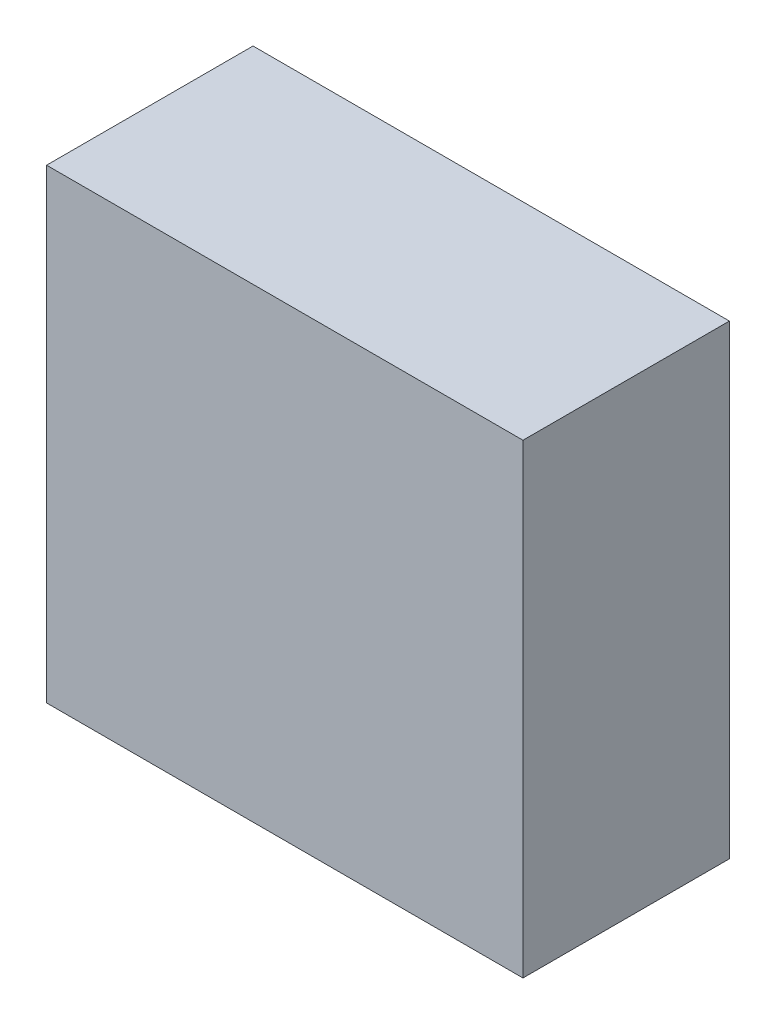
ISO-10303-21;
HEADER;
FILE_DESCRIPTION(('STEP AP214'),'2;1');
FILE_NAME('part.step','',(''),(''),'','','');
FILE_SCHEMA(('AUTOMOTIVE_DESIGN { 1 0 10303 214 1 1 1 1 }'));
ENDSEC;
DATA;
#1=APPLICATION_CONTEXT('core data for automotive mechanical design processes');
#2=APPLICATION_PROTOCOL_DEFINITION('international standard','automotive_design',2000,#1);
#3=PRODUCT_CONTEXT('',#1,'mechanical');
#4=PRODUCT('Part','Part','',(#3));
#5=PRODUCT_RELATED_PRODUCT_CATEGORY('part','',(#4));
#6=PRODUCT_DEFINITION_FORMATION('','',#4);
#7=PRODUCT_DEFINITION_CONTEXT('part definition',#1,'design');
#8=PRODUCT_DEFINITION('design','',#6,#7);
#9=PRODUCT_DEFINITION_SHAPE('','',#8);
#10=(LENGTH_UNIT() NAMED_UNIT(*) SI_UNIT(.MILLI.,.METRE.));
#11=(NAMED_UNIT(*) PLANE_ANGLE_UNIT() SI_UNIT($,.RADIAN.));
#12=(NAMED_UNIT(*) SI_UNIT($,.STERADIAN.) SOLID_ANGLE_UNIT());
#13=UNCERTAINTY_MEASURE_WITH_UNIT(LENGTH_MEASURE(1.E-05),#10,'distance_accuracy_value','');
#14=(GEOMETRIC_REPRESENTATION_CONTEXT(3) GLOBAL_UNCERTAINTY_ASSIGNED_CONTEXT((#13)) GLOBAL_UNIT_ASSIGNED_CONTEXT((#10,
#11,#12)) REPRESENTATION_CONTEXT('',''));
#15=CARTESIAN_POINT('',(0.,0.,0.));
#16=DIRECTION('',(0.,0.,1.));
#17=DIRECTION('',(1.,0.,0.));
#18=AXIS2_PLACEMENT_3D('',#15,#16,#17);
#19=CARTESIAN_POINT('',(4.47700146,-4.37699912,3.87999986));
#20=DIRECTION('',(0.,0.,1.));
#21=DIRECTION('',(1.,0.,0.));
#22=AXIS2_PLACEMENT_3D('',#19,#20,#21);
#23=PLANE('',#22);
#24=DIRECTION('',(0.,1.,0.));
#25=VECTOR('',#24,1.);
#26=CARTESIAN_POINT('',(-4.47699892,-4.37699912,3.87999986));
#27=LINE('',#26,#25);
#28=CARTESIAN_POINT('',(-4.47699892,-4.37699912,3.87999986));
#29=VERTEX_POINT('',#28);
#30=CARTESIAN_POINT('',(-4.47699892,4.37699912,3.87999986));
#31=VERTEX_POINT('',#30);
#32=EDGE_CURVE('E53',#29,#31,#27,.T.);
#33=ORIENTED_EDGE('',*,*,#32,.F.);
#34=DIRECTION('',(1.,0.,0.));
#35=VECTOR('',#34,1.);
#36=CARTESIAN_POINT('',(4.47700146,-4.37699912,3.87999986));
#37=LINE('',#36,#35);
#38=CARTESIAN_POINT('',(4.47700146,-4.37699912,3.87999986));
#39=VERTEX_POINT('',#38);
#40=EDGE_CURVE('E68',#39,#29,#37,.F.);
#41=ORIENTED_EDGE('',*,*,#40,.F.);
#42=DIRECTION('',(0.,1.,0.));
#43=VECTOR('',#42,1.);
#44=CARTESIAN_POINT('',(4.47700146,4.37699912,3.87999986));
#45=LINE('',#44,#43);
#46=CARTESIAN_POINT('',(4.47700146,4.37699912,3.87999986));
#47=VERTEX_POINT('',#46);
#48=EDGE_CURVE('E20',#47,#39,#45,.F.);
#49=ORIENTED_EDGE('',*,*,#48,.F.);
#50=DIRECTION('',(1.,0.,0.));
#51=VECTOR('',#50,1.);
#52=CARTESIAN_POINT('',(-4.47699892,4.37699912,3.87999986));
#53=LINE('',#52,#51);
#54=EDGE_CURVE('E58',#31,#47,#53,.T.);
#55=ORIENTED_EDGE('',*,*,#54,.F.);
#56=EDGE_LOOP('',(#33,#41,#49,#55));
#57=FACE_BOUND('',#56,.T.);
#58=ADVANCED_FACE('F17',(#57),#23,.T.);
#59=CARTESIAN_POINT('',(4.47700146,4.37699912,0.));
#60=DIRECTION('',(1.,0.,0.));
#61=DIRECTION('',(0.,0.,-1.));
#62=AXIS2_PLACEMENT_3D('',#59,#60,#61);
#63=PLANE('',#62);
#64=DIRECTION('',(0.,0.,-1.));
#65=VECTOR('',#64,1.);
#66=CARTESIAN_POINT('',(4.47700146,-4.37699912,0.));
#67=LINE('',#66,#65);
#68=CARTESIAN_POINT('',(4.47700146,-4.37699912,0.));
#69=VERTEX_POINT('',#68);
#70=EDGE_CURVE('E79',#69,#39,#67,.F.);
#71=ORIENTED_EDGE('',*,*,#70,.F.);
#72=DIRECTION('',(0.,1.,0.));
#73=VECTOR('',#72,1.);
#74=CARTESIAN_POINT('',(4.47700146,-4.37699912,0.));
#75=LINE('',#74,#73);
#76=CARTESIAN_POINT('',(4.47700146,4.37699912,0.));
#77=VERTEX_POINT('',#76);
#78=EDGE_CURVE('E74',#69,#77,#75,.T.);
#79=ORIENTED_EDGE('',*,*,#78,.T.);
#80=DIRECTION('',(0.,0.,1.));
#81=VECTOR('',#80,1.);
#82=CARTESIAN_POINT('',(4.47700146,4.37699912,0.));
#83=LINE('',#82,#81);
#84=EDGE_CURVE('E63',#47,#77,#83,.F.);
#85=ORIENTED_EDGE('',*,*,#84,.F.);
#86=ORIENTED_EDGE('',*,*,#48,.T.);
#87=EDGE_LOOP('',(#71,#79,#85,#86));
#88=FACE_BOUND('',#87,.T.);
#89=ADVANCED_FACE('F73',(#88),#63,.T.);
#90=CARTESIAN_POINT('',(-4.47699892,4.37699912,0.));
#91=DIRECTION('',(0.,1.,0.));
#92=DIRECTION('',(0.,0.,1.));
#93=AXIS2_PLACEMENT_3D('',#90,#91,#92);
#94=PLANE('',#93);
#95=ORIENTED_EDGE('',*,*,#84,.T.);
#96=DIRECTION('',(1.,0.,0.));
#97=VECTOR('',#96,1.);
#98=CARTESIAN_POINT('',(4.47700146,4.37699912,0.));
#99=LINE('',#98,#97);
#100=CARTESIAN_POINT('',(-4.47699892,4.37699912,0.));
#101=VERTEX_POINT('',#100);
#102=EDGE_CURVE('E84',#77,#101,#99,.F.);
#103=ORIENTED_EDGE('',*,*,#102,.T.);
#104=DIRECTION('',(0.,0.,1.));
#105=VECTOR('',#104,1.);
#106=CARTESIAN_POINT('',(-4.47699892,4.37699912,0.));
#107=LINE('',#106,#105);
#108=EDGE_CURVE('E65',#31,#101,#107,.F.);
#109=ORIENTED_EDGE('',*,*,#108,.F.);
#110=ORIENTED_EDGE('',*,*,#54,.T.);
#111=EDGE_LOOP('',(#95,#103,#109,#110));
#112=FACE_BOUND('',#111,.T.);
#113=ADVANCED_FACE('F60',(#112),#94,.T.);
#114=CARTESIAN_POINT('',(-4.47699892,-4.37699912,0.));
#115=DIRECTION('',(-1.,0.,0.));
#116=DIRECTION('',(0.,0.,1.));
#117=AXIS2_PLACEMENT_3D('',#114,#115,#116);
#118=PLANE('',#117);
#119=ORIENTED_EDGE('',*,*,#108,.T.);
#120=DIRECTION('',(0.,1.,0.));
#121=VECTOR('',#120,1.);
#122=CARTESIAN_POINT('',(-4.47699892,-4.37699912,0.));
#123=LINE('',#122,#121);
#124=CARTESIAN_POINT('',(-4.47699892,-4.37699912,0.));
#125=VERTEX_POINT('',#124);
#126=EDGE_CURVE('E26',#101,#125,#123,.F.);
#127=ORIENTED_EDGE('',*,*,#126,.T.);
#128=DIRECTION('',(0.,0.,-1.));
#129=VECTOR('',#128,1.);
#130=CARTESIAN_POINT('',(-4.47699892,-4.37699912,0.));
#131=LINE('',#130,#129);
#132=EDGE_CURVE('E34',#29,#125,#131,.T.);
#133=ORIENTED_EDGE('',*,*,#132,.F.);
#134=ORIENTED_EDGE('',*,*,#32,.T.);
#135=EDGE_LOOP('',(#119,#127,#133,#134));
#136=FACE_BOUND('',#135,.T.);
#137=ADVANCED_FACE('F88',(#136),#118,.T.);
#138=CARTESIAN_POINT('',(4.47700146,-4.37699912,0.));
#139=DIRECTION('',(0.,-1.,0.));
#140=DIRECTION('',(0.,0.,-1.));
#141=AXIS2_PLACEMENT_3D('',#138,#139,#140);
#142=PLANE('',#141);
#143=ORIENTED_EDGE('',*,*,#132,.T.);
#144=DIRECTION('',(1.,0.,0.));
#145=VECTOR('',#144,1.);
#146=CARTESIAN_POINT('',(4.47700146,-4.37699912,0.));
#147=LINE('',#146,#145);
#148=EDGE_CURVE('E11',#125,#69,#147,.T.);
#149=ORIENTED_EDGE('',*,*,#148,.T.);
#150=ORIENTED_EDGE('',*,*,#70,.T.);
#151=ORIENTED_EDGE('',*,*,#40,.T.);
#152=EDGE_LOOP('',(#143,#149,#150,#151));
#153=FACE_BOUND('',#152,.T.);
#154=ADVANCED_FACE('F91',(#153),#142,.T.);
#155=CARTESIAN_POINT('',(4.47700146,-4.37699912,0.));
#156=DIRECTION('',(0.,0.,1.));
#157=DIRECTION('',(1.,0.,0.));
#158=AXIS2_PLACEMENT_3D('',#155,#156,#157);
#159=PLANE('',#158);
#160=ORIENTED_EDGE('',*,*,#126,.F.);
#161=ORIENTED_EDGE('',*,*,#102,.F.);
#162=ORIENTED_EDGE('',*,*,#78,.F.);
#163=ORIENTED_EDGE('',*,*,#148,.F.);
#164=EDGE_LOOP('',(#160,#161,#162,#163));
#165=FACE_BOUND('',#164,.T.);
#166=ADVANCED_FACE('F90',(#165),#159,.F.);
#167=CLOSED_SHELL('',(#58,#89,#113,#137,#154,#166));
#168=MANIFOLD_SOLID_BREP('B1',#167);
#169=ADVANCED_BREP_SHAPE_REPRESENTATION('',(#18,#168),#14);
#170=SHAPE_DEFINITION_REPRESENTATION(#9,#169);
ENDSEC;
END-ISO-10303-21;
